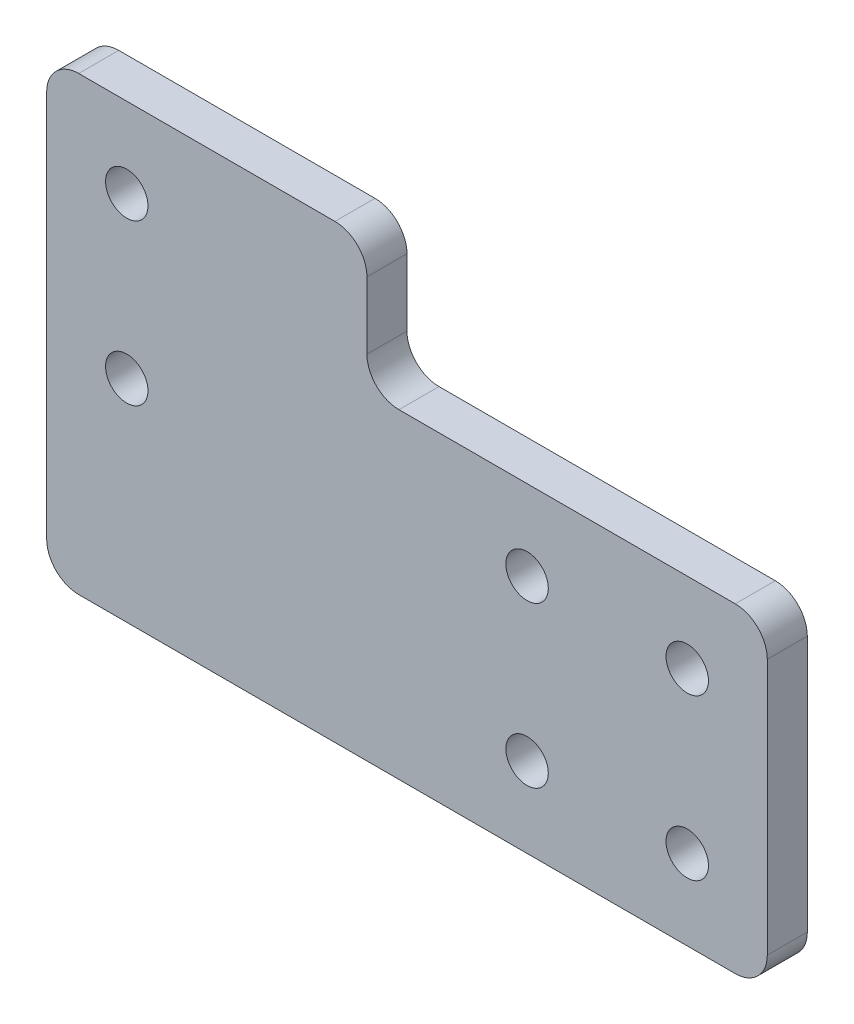
ISO-10303-21;
HEADER;
FILE_DESCRIPTION(('STEP AP214'),'2;1');
FILE_NAME('part.step','',(''),(''),'','','');
FILE_SCHEMA(('AUTOMOTIVE_DESIGN { 1 0 10303 214 1 1 1 1 }'));
ENDSEC;
DATA;
#1=APPLICATION_CONTEXT('core data for automotive mechanical design processes');
#2=APPLICATION_PROTOCOL_DEFINITION('international standard','automotive_design',2000,#1);
#3=PRODUCT_CONTEXT('',#1,'mechanical');
#4=PRODUCT('Part','Part','',(#3));
#5=PRODUCT_RELATED_PRODUCT_CATEGORY('part','',(#4));
#6=PRODUCT_DEFINITION_FORMATION('','',#4);
#7=PRODUCT_DEFINITION_CONTEXT('part definition',#1,'design');
#8=PRODUCT_DEFINITION('design','',#6,#7);
#9=PRODUCT_DEFINITION_SHAPE('','',#8);
#10=(LENGTH_UNIT() NAMED_UNIT(*) SI_UNIT(.MILLI.,.METRE.));
#11=(NAMED_UNIT(*) PLANE_ANGLE_UNIT() SI_UNIT($,.RADIAN.));
#12=(NAMED_UNIT(*) SI_UNIT($,.STERADIAN.) SOLID_ANGLE_UNIT());
#13=UNCERTAINTY_MEASURE_WITH_UNIT(LENGTH_MEASURE(1.E-05),#10,'distance_accuracy_value','');
#14=(GEOMETRIC_REPRESENTATION_CONTEXT(3) GLOBAL_UNCERTAINTY_ASSIGNED_CONTEXT((#13)) GLOBAL_UNIT_ASSIGNED_CONTEXT((#10,
#11,#12)) REPRESENTATION_CONTEXT('',''));
#15=CARTESIAN_POINT('',(0.,0.,0.));
#16=DIRECTION('',(0.,0.,1.));
#17=DIRECTION('',(1.,0.,0.));
#18=AXIS2_PLACEMENT_3D('',#15,#16,#17);
#19=CARTESIAN_POINT('',(-26.,24.,5.));
#20=DIRECTION('',(0.,0.,-1.));
#21=DIRECTION('',(-1.,0.,0.));
#22=AXIS2_PLACEMENT_3D('',#19,#20,#21);
#23=PLANE('',#22);
#24=CARTESIAN_POINT('',(-26.,24.,5.));
#25=DIRECTION('',(0.,0.,-1.));
#26=DIRECTION('',(-1.,0.,0.));
#27=AXIS2_PLACEMENT_3D('',#24,#25,#26);
#28=CIRCLE('',#27,4.00000000000001);
#29=CARTESIAN_POINT('',(-26.,20.,5.));
#30=VERTEX_POINT('',#29);
#31=CARTESIAN_POINT('',(-30.,24.,5.));
#32=VERTEX_POINT('',#31);
#33=EDGE_CURVE('E181',#30,#32,#28,.T.);
#34=ORIENTED_EDGE('',*,*,#33,.T.);
#35=DIRECTION('',(0.,1.,0.));
#36=VECTOR('',#35,1.);
#37=CARTESIAN_POINT('',(-30.,24.,5.));
#38=LINE('',#37,#36);
#39=CARTESIAN_POINT('',(-30.,32.365,5.));
#40=VERTEX_POINT('',#39);
#41=EDGE_CURVE('E108',#32,#40,#38,.T.);
#42=ORIENTED_EDGE('',*,*,#41,.T.);
#43=CARTESIAN_POINT('',(-34.,32.365,5.));
#44=DIRECTION('',(0.,0.,1.));
#45=DIRECTION('',(1.,0.,0.));
#46=AXIS2_PLACEMENT_3D('',#43,#44,#45);
#47=CIRCLE('',#46,4.00000000000001);
#48=CARTESIAN_POINT('',(-34.,36.365,5.));
#49=VERTEX_POINT('',#48);
#50=EDGE_CURVE('E208',#40,#49,#47,.T.);
#51=ORIENTED_EDGE('',*,*,#50,.T.);
#52=DIRECTION('',(-1.,0.,0.));
#53=VECTOR('',#52,1.);
#54=CARTESIAN_POINT('',(-34.,36.365,5.));
#55=LINE('',#54,#53);
#56=CARTESIAN_POINT('',(-66.,36.365,5.));
#57=VERTEX_POINT('',#56);
#58=EDGE_CURVE('E227',#49,#57,#55,.T.);
#59=ORIENTED_EDGE('',*,*,#58,.T.);
#60=CARTESIAN_POINT('',(-66.,32.365,5.));
#61=DIRECTION('',(0.,0.,1.));
#62=DIRECTION('',(1.,0.,0.));
#63=AXIS2_PLACEMENT_3D('',#60,#61,#62);
#64=CIRCLE('',#63,4.00000000000001);
#65=CARTESIAN_POINT('',(-70.,32.365,5.));
#66=VERTEX_POINT('',#65);
#67=EDGE_CURVE('E224',#57,#66,#64,.T.);
#68=ORIENTED_EDGE('',*,*,#67,.T.);
#69=DIRECTION('',(0.,-1.,0.));
#70=VECTOR('',#69,1.);
#71=CARTESIAN_POINT('',(-70.,32.365,5.));
#72=LINE('',#71,#70);
#73=CARTESIAN_POINT('',(-70.,-16.,5.));
#74=VERTEX_POINT('',#73);
#75=EDGE_CURVE('E226',#66,#74,#72,.T.);
#76=ORIENTED_EDGE('',*,*,#75,.T.);
#77=CARTESIAN_POINT('',(-66.,-16.,5.));
#78=DIRECTION('',(0.,0.,1.));
#79=DIRECTION('',(1.,0.,0.));
#80=AXIS2_PLACEMENT_3D('',#77,#78,#79);
#81=CIRCLE('',#80,4.00000000000001);
#82=CARTESIAN_POINT('',(-66.,-20.,5.));
#83=VERTEX_POINT('',#82);
#84=EDGE_CURVE('E229',#74,#83,#81,.T.);
#85=ORIENTED_EDGE('',*,*,#84,.T.);
#86=DIRECTION('',(1.,0.,0.));
#87=VECTOR('',#86,1.);
#88=CARTESIAN_POINT('',(-66.,-20.,5.));
#89=LINE('',#88,#87);
#90=CARTESIAN_POINT('',(16.,-20.,5.));
#91=VERTEX_POINT('',#90);
#92=EDGE_CURVE('E235',#83,#91,#89,.T.);
#93=ORIENTED_EDGE('',*,*,#92,.T.);
#94=CARTESIAN_POINT('',(16.,-16.,5.));
#95=DIRECTION('',(0.,0.,1.));
#96=DIRECTION('',(1.,0.,0.));
#97=AXIS2_PLACEMENT_3D('',#94,#95,#96);
#98=CIRCLE('',#97,4.);
#99=CARTESIAN_POINT('',(20.,-16.,5.));
#100=VERTEX_POINT('',#99);
#101=EDGE_CURVE('E139',#91,#100,#98,.T.);
#102=ORIENTED_EDGE('',*,*,#101,.T.);
#103=DIRECTION('',(0.,1.,0.));
#104=VECTOR('',#103,1.);
#105=CARTESIAN_POINT('',(20.,-16.,5.));
#106=LINE('',#105,#104);
#107=CARTESIAN_POINT('',(20.,16.,5.));
#108=VERTEX_POINT('',#107);
#109=EDGE_CURVE('E133',#100,#108,#106,.T.);
#110=ORIENTED_EDGE('',*,*,#109,.T.);
#111=CARTESIAN_POINT('',(16.,16.,5.));
#112=DIRECTION('',(0.,0.,1.));
#113=DIRECTION('',(1.,0.,0.));
#114=AXIS2_PLACEMENT_3D('',#111,#112,#113);
#115=CIRCLE('',#114,4.);
#116=CARTESIAN_POINT('',(16.,20.,5.));
#117=VERTEX_POINT('',#116);
#118=EDGE_CURVE('E137',#108,#117,#115,.T.);
#119=ORIENTED_EDGE('',*,*,#118,.T.);
#120=DIRECTION('',(-1.,0.,0.));
#121=VECTOR('',#120,1.);
#122=CARTESIAN_POINT('',(16.,20.,5.));
#123=LINE('',#122,#121);
#124=EDGE_CURVE('E53',#117,#30,#123,.T.);
#125=ORIENTED_EDGE('',*,*,#124,.T.);
#126=EDGE_LOOP('',(#34,#42,#51,#59,#68,#76,#85,#93,#102,#110,#119,#125));
#127=FACE_BOUND('',#126,.T.);
#128=CARTESIAN_POINT('',(-10.,10.,5.));
#129=DIRECTION('',(0.,0.,1.));
#130=DIRECTION('',(1.,0.,0.));
#131=AXIS2_PLACEMENT_3D('',#128,#129,#130);
#132=CIRCLE('',#131,2.65);
#133=CARTESIAN_POINT('',(-7.35,10.,5.));
#134=VERTEX_POINT('',#133);
#135=EDGE_CURVE('E162',#134,#134,#132,.T.);
#136=ORIENTED_EDGE('',*,*,#135,.F.);
#137=EDGE_LOOP('',(#136));
#138=FACE_BOUND('',#137,.T.);
#139=CARTESIAN_POINT('',(-10.,-10.,5.));
#140=DIRECTION('',(0.,0.,1.));
#141=DIRECTION('',(1.,0.,0.));
#142=AXIS2_PLACEMENT_3D('',#139,#140,#141);
#143=CIRCLE('',#142,2.65);
#144=CARTESIAN_POINT('',(-7.35,-10.,5.));
#145=VERTEX_POINT('',#144);
#146=EDGE_CURVE('E319',#145,#145,#143,.T.);
#147=ORIENTED_EDGE('',*,*,#146,.F.);
#148=EDGE_LOOP('',(#147));
#149=FACE_BOUND('',#148,.T.);
#150=CARTESIAN_POINT('',(10.,10.,5.));
#151=DIRECTION('',(0.,0.,1.));
#152=DIRECTION('',(1.,0.,0.));
#153=AXIS2_PLACEMENT_3D('',#150,#151,#152);
#154=CIRCLE('',#153,2.65);
#155=CARTESIAN_POINT('',(12.65,10.,5.));
#156=VERTEX_POINT('',#155);
#157=EDGE_CURVE('E313',#156,#156,#154,.T.);
#158=ORIENTED_EDGE('',*,*,#157,.F.);
#159=EDGE_LOOP('',(#158));
#160=FACE_BOUND('',#159,.T.);
#161=CARTESIAN_POINT('',(10.,-10.,5.));
#162=DIRECTION('',(0.,0.,1.));
#163=DIRECTION('',(1.,0.,0.));
#164=AXIS2_PLACEMENT_3D('',#161,#162,#163);
#165=CIRCLE('',#164,2.65000000000001);
#166=CARTESIAN_POINT('',(12.65,-10.,5.));
#167=VERTEX_POINT('',#166);
#168=EDGE_CURVE('E307',#167,#167,#165,.T.);
#169=ORIENTED_EDGE('',*,*,#168,.F.);
#170=EDGE_LOOP('',(#169));
#171=FACE_BOUND('',#170,.T.);
#172=CARTESIAN_POINT('',(-60.,26.365,5.));
#173=DIRECTION('',(0.,0.,1.));
#174=DIRECTION('',(1.,0.,0.));
#175=AXIS2_PLACEMENT_3D('',#172,#173,#174);
#176=CIRCLE('',#175,2.65);
#177=CARTESIAN_POINT('',(-57.35,26.365,5.));
#178=VERTEX_POINT('',#177);
#179=EDGE_CURVE('E301',#178,#178,#176,.T.);
#180=ORIENTED_EDGE('',*,*,#179,.F.);
#181=EDGE_LOOP('',(#180));
#182=FACE_BOUND('',#181,.T.);
#183=CARTESIAN_POINT('',(-60.,6.36499999999999,5.));
#184=DIRECTION('',(0.,0.,1.));
#185=DIRECTION('',(1.,0.,0.));
#186=AXIS2_PLACEMENT_3D('',#183,#184,#185);
#187=CIRCLE('',#186,2.65);
#188=CARTESIAN_POINT('',(-57.35,6.36499999999999,5.));
#189=VERTEX_POINT('',#188);
#190=EDGE_CURVE('E292',#189,#189,#187,.T.);
#191=ORIENTED_EDGE('',*,*,#190,.F.);
#192=EDGE_LOOP('',(#191));
#193=FACE_BOUND('',#192,.T.);
#194=ADVANCED_FACE('F36',(#127,#138,#149,#160,#171,#182,#193),#23,.F.);
#195=CARTESIAN_POINT('',(-26.,24.,0.));
#196=DIRECTION('',(0.,0.,-1.));
#197=DIRECTION('',(-1.,0.,0.));
#198=AXIS2_PLACEMENT_3D('',#195,#196,#197);
#199=PLANE('',#198);
#200=CARTESIAN_POINT('',(-60.,26.365,0.));
#201=DIRECTION('',(0.,0.,1.));
#202=DIRECTION('',(1.,0.,0.));
#203=AXIS2_PLACEMENT_3D('',#200,#201,#202);
#204=CIRCLE('',#203,2.65);
#205=CARTESIAN_POINT('',(-57.35,26.365,0.));
#206=VERTEX_POINT('',#205);
#207=EDGE_CURVE('E298',#206,#206,#204,.T.);
#208=ORIENTED_EDGE('',*,*,#207,.T.);
#209=EDGE_LOOP('',(#208));
#210=FACE_BOUND('',#209,.T.);
#211=CARTESIAN_POINT('',(10.,10.,0.));
#212=DIRECTION('',(0.,0.,1.));
#213=DIRECTION('',(1.,0.,0.));
#214=AXIS2_PLACEMENT_3D('',#211,#212,#213);
#215=CIRCLE('',#214,2.65);
#216=CARTESIAN_POINT('',(12.65,10.,0.));
#217=VERTEX_POINT('',#216);
#218=EDGE_CURVE('E310',#217,#217,#215,.T.);
#219=ORIENTED_EDGE('',*,*,#218,.T.);
#220=EDGE_LOOP('',(#219));
#221=FACE_BOUND('',#220,.T.);
#222=CARTESIAN_POINT('',(-10.,10.,0.));
#223=DIRECTION('',(0.,0.,1.));
#224=DIRECTION('',(1.,0.,0.));
#225=AXIS2_PLACEMENT_3D('',#222,#223,#224);
#226=CIRCLE('',#225,2.65);
#227=CARTESIAN_POINT('',(-7.35,10.,0.));
#228=VERTEX_POINT('',#227);
#229=EDGE_CURVE('E322',#228,#228,#226,.T.);
#230=ORIENTED_EDGE('',*,*,#229,.T.);
#231=EDGE_LOOP('',(#230));
#232=FACE_BOUND('',#231,.T.);
#233=CARTESIAN_POINT('',(-26.,24.,0.));
#234=DIRECTION('',(0.,0.,-1.));
#235=DIRECTION('',(-1.,0.,0.));
#236=AXIS2_PLACEMENT_3D('',#233,#234,#235);
#237=CIRCLE('',#236,4.00000000000001);
#238=CARTESIAN_POINT('',(-26.,20.,0.));
#239=VERTEX_POINT('',#238);
#240=CARTESIAN_POINT('',(-30.,24.,0.));
#241=VERTEX_POINT('',#240);
#242=EDGE_CURVE('E158',#239,#241,#237,.T.);
#243=ORIENTED_EDGE('',*,*,#242,.F.);
#244=DIRECTION('',(-1.,0.,0.));
#245=VECTOR('',#244,1.);
#246=CARTESIAN_POINT('',(16.,20.,0.));
#247=LINE('',#246,#245);
#248=CARTESIAN_POINT('',(16.,20.,0.));
#249=VERTEX_POINT('',#248);
#250=EDGE_CURVE('E100',#249,#239,#247,.T.);
#251=ORIENTED_EDGE('',*,*,#250,.F.);
#252=CARTESIAN_POINT('',(16.,16.,0.));
#253=DIRECTION('',(0.,0.,1.));
#254=DIRECTION('',(1.,0.,0.));
#255=AXIS2_PLACEMENT_3D('',#252,#253,#254);
#256=CIRCLE('',#255,4.);
#257=CARTESIAN_POINT('',(20.,16.,0.));
#258=VERTEX_POINT('',#257);
#259=EDGE_CURVE('E94',#258,#249,#256,.T.);
#260=ORIENTED_EDGE('',*,*,#259,.F.);
#261=DIRECTION('',(0.,1.,0.));
#262=VECTOR('',#261,1.);
#263=CARTESIAN_POINT('',(20.,-16.,0.));
#264=LINE('',#263,#262);
#265=CARTESIAN_POINT('',(20.,-16.,0.));
#266=VERTEX_POINT('',#265);
#267=EDGE_CURVE('E147',#266,#258,#264,.T.);
#268=ORIENTED_EDGE('',*,*,#267,.F.);
#269=CARTESIAN_POINT('',(16.,-16.,0.));
#270=DIRECTION('',(0.,0.,1.));
#271=DIRECTION('',(1.,0.,0.));
#272=AXIS2_PLACEMENT_3D('',#269,#270,#271);
#273=CIRCLE('',#272,4.);
#274=CARTESIAN_POINT('',(16.,-20.,0.));
#275=VERTEX_POINT('',#274);
#276=EDGE_CURVE('E176',#275,#266,#273,.T.);
#277=ORIENTED_EDGE('',*,*,#276,.F.);
#278=DIRECTION('',(1.,0.,0.));
#279=VECTOR('',#278,1.);
#280=CARTESIAN_POINT('',(-66.,-20.,0.));
#281=LINE('',#280,#279);
#282=CARTESIAN_POINT('',(-66.,-20.,0.));
#283=VERTEX_POINT('',#282);
#284=EDGE_CURVE('E174',#283,#275,#281,.T.);
#285=ORIENTED_EDGE('',*,*,#284,.F.);
#286=CARTESIAN_POINT('',(-66.,-16.,0.));
#287=DIRECTION('',(0.,0.,1.));
#288=DIRECTION('',(1.,0.,0.));
#289=AXIS2_PLACEMENT_3D('',#286,#287,#288);
#290=CIRCLE('',#289,4.00000000000001);
#291=CARTESIAN_POINT('',(-70.,-16.,0.));
#292=VERTEX_POINT('',#291);
#293=EDGE_CURVE('E172',#292,#283,#290,.T.);
#294=ORIENTED_EDGE('',*,*,#293,.F.);
#295=DIRECTION('',(0.,-1.,0.));
#296=VECTOR('',#295,1.);
#297=CARTESIAN_POINT('',(-70.,32.365,0.));
#298=LINE('',#297,#296);
#299=CARTESIAN_POINT('',(-70.,32.365,0.));
#300=VERTEX_POINT('',#299);
#301=EDGE_CURVE('E170',#300,#292,#298,.T.);
#302=ORIENTED_EDGE('',*,*,#301,.F.);
#303=CARTESIAN_POINT('',(-66.,32.365,0.));
#304=DIRECTION('',(0.,0.,1.));
#305=DIRECTION('',(1.,0.,0.));
#306=AXIS2_PLACEMENT_3D('',#303,#304,#305);
#307=CIRCLE('',#306,4.00000000000001);
#308=CARTESIAN_POINT('',(-66.,36.365,0.));
#309=VERTEX_POINT('',#308);
#310=EDGE_CURVE('E168',#309,#300,#307,.T.);
#311=ORIENTED_EDGE('',*,*,#310,.F.);
#312=DIRECTION('',(-1.,0.,0.));
#313=VECTOR('',#312,1.);
#314=CARTESIAN_POINT('',(-34.,36.365,0.));
#315=LINE('',#314,#313);
#316=CARTESIAN_POINT('',(-34.,36.365,0.));
#317=VERTEX_POINT('',#316);
#318=EDGE_CURVE('E166',#317,#309,#315,.T.);
#319=ORIENTED_EDGE('',*,*,#318,.F.);
#320=CARTESIAN_POINT('',(-34.,32.365,0.));
#321=DIRECTION('',(0.,0.,1.));
#322=DIRECTION('',(1.,0.,0.));
#323=AXIS2_PLACEMENT_3D('',#320,#321,#322);
#324=CIRCLE('',#323,4.00000000000001);
#325=CARTESIAN_POINT('',(-30.,32.365,0.));
#326=VERTEX_POINT('',#325);
#327=EDGE_CURVE('E164',#326,#317,#324,.T.);
#328=ORIENTED_EDGE('',*,*,#327,.F.);
#329=DIRECTION('',(0.,1.,0.));
#330=VECTOR('',#329,1.);
#331=CARTESIAN_POINT('',(-30.,24.,0.));
#332=LINE('',#331,#330);
#333=EDGE_CURVE('E161',#241,#326,#332,.T.);
#334=ORIENTED_EDGE('',*,*,#333,.F.);
#335=EDGE_LOOP('',(#243,#251,#260,#268,#277,#285,#294,#302,#311,#319,#328,#334));
#336=FACE_BOUND('',#335,.T.);
#337=CARTESIAN_POINT('',(-10.,-10.,0.));
#338=DIRECTION('',(0.,0.,1.));
#339=DIRECTION('',(1.,0.,0.));
#340=AXIS2_PLACEMENT_3D('',#337,#338,#339);
#341=CIRCLE('',#340,2.65);
#342=CARTESIAN_POINT('',(-7.35,-10.,0.));
#343=VERTEX_POINT('',#342);
#344=EDGE_CURVE('E316',#343,#343,#341,.T.);
#345=ORIENTED_EDGE('',*,*,#344,.T.);
#346=EDGE_LOOP('',(#345));
#347=FACE_BOUND('',#346,.T.);
#348=CARTESIAN_POINT('',(10.,-10.,0.));
#349=DIRECTION('',(0.,0.,1.));
#350=DIRECTION('',(1.,0.,0.));
#351=AXIS2_PLACEMENT_3D('',#348,#349,#350);
#352=CIRCLE('',#351,2.65000000000001);
#353=CARTESIAN_POINT('',(12.65,-10.,0.));
#354=VERTEX_POINT('',#353);
#355=EDGE_CURVE('E304',#354,#354,#352,.T.);
#356=ORIENTED_EDGE('',*,*,#355,.T.);
#357=EDGE_LOOP('',(#356));
#358=FACE_BOUND('',#357,.T.);
#359=CARTESIAN_POINT('',(-60.,6.36499999999999,0.));
#360=DIRECTION('',(0.,0.,1.));
#361=DIRECTION('',(1.,0.,0.));
#362=AXIS2_PLACEMENT_3D('',#359,#360,#361);
#363=CIRCLE('',#362,2.65);
#364=CARTESIAN_POINT('',(-57.35,6.36499999999999,0.));
#365=VERTEX_POINT('',#364);
#366=EDGE_CURVE('E295',#365,#365,#363,.T.);
#367=ORIENTED_EDGE('',*,*,#366,.T.);
#368=EDGE_LOOP('',(#367));
#369=FACE_BOUND('',#368,.T.);
#370=ADVANCED_FACE('F212',(#210,#221,#232,#336,#347,#358,#369),#199,.T.);
#371=CARTESIAN_POINT('',(-26.,24.,5.));
#372=DIRECTION('',(0.,0.,-1.));
#373=DIRECTION('',(-1.,0.,0.));
#374=AXIS2_PLACEMENT_3D('',#371,#372,#373);
#375=CYLINDRICAL_SURFACE('',#374,4.00000000000001);
#376=ORIENTED_EDGE('',*,*,#242,.T.);
#377=DIRECTION('',(0.,0.,-1.));
#378=VECTOR('',#377,1.);
#379=CARTESIAN_POINT('',(-30.,24.,5.));
#380=LINE('',#379,#378);
#381=EDGE_CURVE('E11',#32,#241,#380,.T.);
#382=ORIENTED_EDGE('',*,*,#381,.F.);
#383=ORIENTED_EDGE('',*,*,#33,.F.);
#384=DIRECTION('',(0.,0.,-1.));
#385=VECTOR('',#384,1.);
#386=CARTESIAN_POINT('',(-26.,20.,5.));
#387=LINE('',#386,#385);
#388=EDGE_CURVE('E154',#30,#239,#387,.T.);
#389=ORIENTED_EDGE('',*,*,#388,.T.);
#390=EDGE_LOOP('',(#376,#382,#383,#389));
#391=FACE_BOUND('',#390,.T.);
#392=ADVANCED_FACE('F38',(#391),#375,.F.);
#393=CARTESIAN_POINT('',(-30.,24.,5.));
#394=DIRECTION('',(-1.,0.,0.));
#395=DIRECTION('',(0.,-1.,0.));
#396=AXIS2_PLACEMENT_3D('',#393,#394,#395);
#397=PLANE('',#396);
#398=ORIENTED_EDGE('',*,*,#333,.T.);
#399=DIRECTION('',(0.,0.,-1.));
#400=VECTOR('',#399,1.);
#401=CARTESIAN_POINT('',(-30.,32.365,5.));
#402=LINE('',#401,#400);
#403=EDGE_CURVE('E45',#40,#326,#402,.T.);
#404=ORIENTED_EDGE('',*,*,#403,.F.);
#405=ORIENTED_EDGE('',*,*,#41,.F.);
#406=ORIENTED_EDGE('',*,*,#381,.T.);
#407=EDGE_LOOP('',(#398,#404,#405,#406));
#408=FACE_BOUND('',#407,.T.);
#409=ADVANCED_FACE('F452',(#408),#397,.F.);
#410=CARTESIAN_POINT('',(-34.,32.365,5.));
#411=DIRECTION('',(0.,0.,-1.));
#412=DIRECTION('',(-1.,0.,0.));
#413=AXIS2_PLACEMENT_3D('',#410,#411,#412);
#414=CYLINDRICAL_SURFACE('',#413,4.00000000000001);
#415=ORIENTED_EDGE('',*,*,#327,.T.);
#416=DIRECTION('',(0.,0.,-1.));
#417=VECTOR('',#416,1.);
#418=CARTESIAN_POINT('',(-34.,36.365,5.));
#419=LINE('',#418,#417);
#420=EDGE_CURVE('E200',#49,#317,#419,.T.);
#421=ORIENTED_EDGE('',*,*,#420,.F.);
#422=ORIENTED_EDGE('',*,*,#50,.F.);
#423=ORIENTED_EDGE('',*,*,#403,.T.);
#424=EDGE_LOOP('',(#415,#421,#422,#423));
#425=FACE_BOUND('',#424,.T.);
#426=ADVANCED_FACE('F206',(#425),#414,.T.);
#427=CARTESIAN_POINT('',(-34.,36.365,5.));
#428=DIRECTION('',(0.,-1.,0.));
#429=DIRECTION('',(1.,0.,0.));
#430=AXIS2_PLACEMENT_3D('',#427,#428,#429);
#431=PLANE('',#430);
#432=ORIENTED_EDGE('',*,*,#318,.T.);
#433=DIRECTION('',(0.,0.,-1.));
#434=VECTOR('',#433,1.);
#435=CARTESIAN_POINT('',(-66.,36.365,5.));
#436=LINE('',#435,#434);
#437=EDGE_CURVE('E197',#57,#309,#436,.T.);
#438=ORIENTED_EDGE('',*,*,#437,.F.);
#439=ORIENTED_EDGE('',*,*,#58,.F.);
#440=ORIENTED_EDGE('',*,*,#420,.T.);
#441=EDGE_LOOP('',(#432,#438,#439,#440));
#442=FACE_BOUND('',#441,.T.);
#443=ADVANCED_FACE('F218',(#442),#431,.F.);
#444=CARTESIAN_POINT('',(-66.,32.365,5.));
#445=DIRECTION('',(0.,0.,-1.));
#446=DIRECTION('',(-1.,0.,0.));
#447=AXIS2_PLACEMENT_3D('',#444,#445,#446);
#448=CYLINDRICAL_SURFACE('',#447,4.00000000000001);
#449=ORIENTED_EDGE('',*,*,#310,.T.);
#450=DIRECTION('',(0.,0.,-1.));
#451=VECTOR('',#450,1.);
#452=CARTESIAN_POINT('',(-70.,32.365,5.));
#453=LINE('',#452,#451);
#454=EDGE_CURVE('E194',#66,#300,#453,.T.);
#455=ORIENTED_EDGE('',*,*,#454,.F.);
#456=ORIENTED_EDGE('',*,*,#67,.F.);
#457=ORIENTED_EDGE('',*,*,#437,.T.);
#458=EDGE_LOOP('',(#449,#455,#456,#457));
#459=FACE_BOUND('',#458,.T.);
#460=ADVANCED_FACE('F222',(#459),#448,.T.);
#461=CARTESIAN_POINT('',(-70.,32.365,5.));
#462=DIRECTION('',(1.,0.,0.));
#463=DIRECTION('',(0.,1.,0.));
#464=AXIS2_PLACEMENT_3D('',#461,#462,#463);
#465=PLANE('',#464);
#466=ORIENTED_EDGE('',*,*,#301,.T.);
#467=DIRECTION('',(0.,0.,-1.));
#468=VECTOR('',#467,1.);
#469=CARTESIAN_POINT('',(-70.,-16.,5.));
#470=LINE('',#469,#468);
#471=EDGE_CURVE('E191',#74,#292,#470,.T.);
#472=ORIENTED_EDGE('',*,*,#471,.F.);
#473=ORIENTED_EDGE('',*,*,#75,.F.);
#474=ORIENTED_EDGE('',*,*,#454,.T.);
#475=EDGE_LOOP('',(#466,#472,#473,#474));
#476=FACE_BOUND('',#475,.T.);
#477=ADVANCED_FACE('F417',(#476),#465,.F.);
#478=CARTESIAN_POINT('',(-66.,-16.,5.));
#479=DIRECTION('',(0.,0.,-1.));
#480=DIRECTION('',(-1.,0.,0.));
#481=AXIS2_PLACEMENT_3D('',#478,#479,#480);
#482=CYLINDRICAL_SURFACE('',#481,4.00000000000001);
#483=ORIENTED_EDGE('',*,*,#293,.T.);
#484=DIRECTION('',(0.,0.,-1.));
#485=VECTOR('',#484,1.);
#486=CARTESIAN_POINT('',(-66.,-20.,5.));
#487=LINE('',#486,#485);
#488=EDGE_CURVE('E188',#83,#283,#487,.T.);
#489=ORIENTED_EDGE('',*,*,#488,.F.);
#490=ORIENTED_EDGE('',*,*,#84,.F.);
#491=ORIENTED_EDGE('',*,*,#471,.T.);
#492=EDGE_LOOP('',(#483,#489,#490,#491));
#493=FACE_BOUND('',#492,.T.);
#494=ADVANCED_FACE('F408',(#493),#482,.T.);
#495=CARTESIAN_POINT('',(-66.,-20.,5.));
#496=DIRECTION('',(0.,1.,0.));
#497=DIRECTION('',(-1.,0.,0.));
#498=AXIS2_PLACEMENT_3D('',#495,#496,#497);
#499=PLANE('',#498);
#500=ORIENTED_EDGE('',*,*,#284,.T.);
#501=DIRECTION('',(0.,0.,-1.));
#502=VECTOR('',#501,1.);
#503=CARTESIAN_POINT('',(16.,-20.,5.));
#504=LINE('',#503,#502);
#505=EDGE_CURVE('E185',#91,#275,#504,.T.);
#506=ORIENTED_EDGE('',*,*,#505,.F.);
#507=ORIENTED_EDGE('',*,*,#92,.F.);
#508=ORIENTED_EDGE('',*,*,#488,.T.);
#509=EDGE_LOOP('',(#500,#506,#507,#508));
#510=FACE_BOUND('',#509,.T.);
#511=ADVANCED_FACE('F241',(#510),#499,.F.);
#512=CARTESIAN_POINT('',(16.,-16.,5.));
#513=DIRECTION('',(0.,0.,-1.));
#514=DIRECTION('',(-1.,0.,0.));
#515=AXIS2_PLACEMENT_3D('',#512,#513,#514);
#516=CYLINDRICAL_SURFACE('',#515,4.);
#517=ORIENTED_EDGE('',*,*,#276,.T.);
#518=DIRECTION('',(0.,0.,-1.));
#519=VECTOR('',#518,1.);
#520=CARTESIAN_POINT('',(20.,-16.,5.));
#521=LINE('',#520,#519);
#522=EDGE_CURVE('E148',#100,#266,#521,.T.);
#523=ORIENTED_EDGE('',*,*,#522,.F.);
#524=ORIENTED_EDGE('',*,*,#101,.F.);
#525=ORIENTED_EDGE('',*,*,#505,.T.);
#526=EDGE_LOOP('',(#517,#523,#524,#525));
#527=FACE_BOUND('',#526,.T.);
#528=ADVANCED_FACE('F245',(#527),#516,.T.);
#529=CARTESIAN_POINT('',(20.,-16.,5.));
#530=DIRECTION('',(-1.,0.,0.));
#531=DIRECTION('',(0.,-1.,0.));
#532=AXIS2_PLACEMENT_3D('',#529,#530,#531);
#533=PLANE('',#532);
#534=ORIENTED_EDGE('',*,*,#267,.T.);
#535=DIRECTION('',(0.,0.,-1.));
#536=VECTOR('',#535,1.);
#537=CARTESIAN_POINT('',(20.,16.,5.));
#538=LINE('',#537,#536);
#539=EDGE_CURVE('E144',#108,#258,#538,.T.);
#540=ORIENTED_EDGE('',*,*,#539,.F.);
#541=ORIENTED_EDGE('',*,*,#109,.F.);
#542=ORIENTED_EDGE('',*,*,#522,.T.);
#543=EDGE_LOOP('',(#534,#540,#541,#542));
#544=FACE_BOUND('',#543,.T.);
#545=ADVANCED_FACE('F145',(#544),#533,.F.);
#546=CARTESIAN_POINT('',(16.,16.,5.));
#547=DIRECTION('',(0.,0.,-1.));
#548=DIRECTION('',(-1.,0.,0.));
#549=AXIS2_PLACEMENT_3D('',#546,#547,#548);
#550=CYLINDRICAL_SURFACE('',#549,4.);
#551=ORIENTED_EDGE('',*,*,#259,.T.);
#552=DIRECTION('',(0.,0.,-1.));
#553=VECTOR('',#552,1.);
#554=CARTESIAN_POINT('',(16.,20.,5.));
#555=LINE('',#554,#553);
#556=EDGE_CURVE('E149',#117,#249,#555,.T.);
#557=ORIENTED_EDGE('',*,*,#556,.F.);
#558=ORIENTED_EDGE('',*,*,#118,.F.);
#559=ORIENTED_EDGE('',*,*,#539,.T.);
#560=EDGE_LOOP('',(#551,#557,#558,#559));
#561=FACE_BOUND('',#560,.T.);
#562=ADVANCED_FACE('F151',(#561),#550,.T.);
#563=CARTESIAN_POINT('',(16.,20.,5.));
#564=DIRECTION('',(0.,-1.,0.));
#565=DIRECTION('',(1.,0.,0.));
#566=AXIS2_PLACEMENT_3D('',#563,#564,#565);
#567=PLANE('',#566);
#568=ORIENTED_EDGE('',*,*,#250,.T.);
#569=ORIENTED_EDGE('',*,*,#388,.F.);
#570=ORIENTED_EDGE('',*,*,#124,.F.);
#571=ORIENTED_EDGE('',*,*,#556,.T.);
#572=EDGE_LOOP('',(#568,#569,#570,#571));
#573=FACE_BOUND('',#572,.T.);
#574=ADVANCED_FACE('F249',(#573),#567,.F.);
#575=CARTESIAN_POINT('',(-10.,10.,5.));
#576=DIRECTION('',(0.,0.,-1.));
#577=DIRECTION('',(-1.,0.,0.));
#578=AXIS2_PLACEMENT_3D('',#575,#576,#577);
#579=CYLINDRICAL_SURFACE('',#578,2.65);
#580=ORIENTED_EDGE('',*,*,#135,.T.);
#581=EDGE_LOOP('',(#580));
#582=FACE_BOUND('',#581,.T.);
#583=ORIENTED_EDGE('',*,*,#229,.F.);
#584=EDGE_LOOP('',(#583));
#585=FACE_BOUND('',#584,.T.);
#586=ADVANCED_FACE('F251',(#582,#585),#579,.F.);
#587=CARTESIAN_POINT('',(-10.,-10.,5.));
#588=DIRECTION('',(0.,0.,-1.));
#589=DIRECTION('',(-1.,0.,0.));
#590=AXIS2_PLACEMENT_3D('',#587,#588,#589);
#591=CYLINDRICAL_SURFACE('',#590,2.65);
#592=ORIENTED_EDGE('',*,*,#146,.T.);
#593=EDGE_LOOP('',(#592));
#594=FACE_BOUND('',#593,.T.);
#595=ORIENTED_EDGE('',*,*,#344,.F.);
#596=EDGE_LOOP('',(#595));
#597=FACE_BOUND('',#596,.T.);
#598=ADVANCED_FACE('F257',(#594,#597),#591,.F.);
#599=CARTESIAN_POINT('',(10.,10.,5.));
#600=DIRECTION('',(0.,0.,-1.));
#601=DIRECTION('',(-1.,0.,0.));
#602=AXIS2_PLACEMENT_3D('',#599,#600,#601);
#603=CYLINDRICAL_SURFACE('',#602,2.65);
#604=ORIENTED_EDGE('',*,*,#157,.T.);
#605=EDGE_LOOP('',(#604));
#606=FACE_BOUND('',#605,.T.);
#607=ORIENTED_EDGE('',*,*,#218,.F.);
#608=EDGE_LOOP('',(#607));
#609=FACE_BOUND('',#608,.T.);
#610=ADVANCED_FACE('F271',(#606,#609),#603,.F.);
#611=CARTESIAN_POINT('',(10.,-10.,5.));
#612=DIRECTION('',(0.,0.,-1.));
#613=DIRECTION('',(-1.,0.,0.));
#614=AXIS2_PLACEMENT_3D('',#611,#612,#613);
#615=CYLINDRICAL_SURFACE('',#614,2.65000000000001);
#616=ORIENTED_EDGE('',*,*,#168,.T.);
#617=EDGE_LOOP('',(#616));
#618=FACE_BOUND('',#617,.T.);
#619=ORIENTED_EDGE('',*,*,#355,.F.);
#620=EDGE_LOOP('',(#619));
#621=FACE_BOUND('',#620,.T.);
#622=ADVANCED_FACE('F275',(#618,#621),#615,.F.);
#623=CARTESIAN_POINT('',(-60.,26.365,5.));
#624=DIRECTION('',(0.,0.,-1.));
#625=DIRECTION('',(-1.,0.,0.));
#626=AXIS2_PLACEMENT_3D('',#623,#624,#625);
#627=CYLINDRICAL_SURFACE('',#626,2.65);
#628=ORIENTED_EDGE('',*,*,#179,.T.);
#629=EDGE_LOOP('',(#628));
#630=FACE_BOUND('',#629,.T.);
#631=ORIENTED_EDGE('',*,*,#207,.F.);
#632=EDGE_LOOP('',(#631));
#633=FACE_BOUND('',#632,.T.);
#634=ADVANCED_FACE('F279',(#630,#633),#627,.F.);
#635=CARTESIAN_POINT('',(-60.,6.36499999999999,5.));
#636=DIRECTION('',(0.,0.,-1.));
#637=DIRECTION('',(-1.,0.,0.));
#638=AXIS2_PLACEMENT_3D('',#635,#636,#637);
#639=CYLINDRICAL_SURFACE('',#638,2.65);
#640=ORIENTED_EDGE('',*,*,#190,.T.);
#641=EDGE_LOOP('',(#640));
#642=FACE_BOUND('',#641,.T.);
#643=ORIENTED_EDGE('',*,*,#366,.F.);
#644=EDGE_LOOP('',(#643));
#645=FACE_BOUND('',#644,.T.);
#646=ADVANCED_FACE('F283',(#642,#645),#639,.F.);
#647=CLOSED_SHELL('',(#194,#370,#392,#409,#426,#443,#460,#477,#494,#511,#528,#545,#562,#574,
#586,#598,#610,#622,#634,#646));
#648=MANIFOLD_SOLID_BREP('B2',#647);
#649=ADVANCED_BREP_SHAPE_REPRESENTATION('',(#18,#648),#14);
#650=SHAPE_DEFINITION_REPRESENTATION(#9,#649);
ENDSEC;
END-ISO-10303-21;
